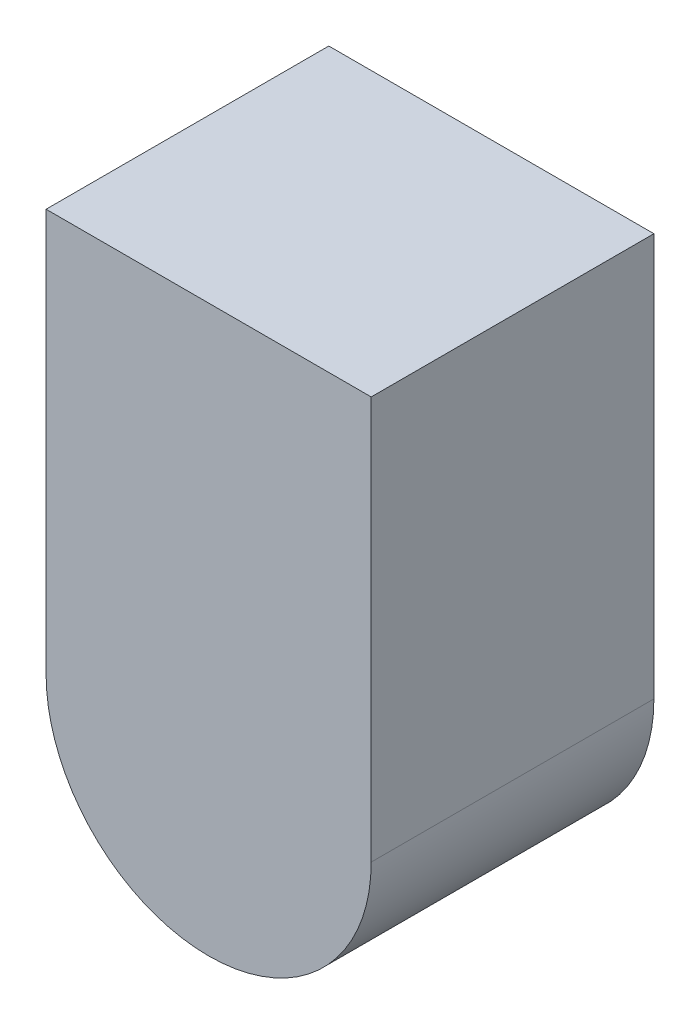
ISO-10303-21;
HEADER;
FILE_DESCRIPTION(('STEP AP214'),'2;1');
FILE_NAME('part.step','',(''),(''),'','','');
FILE_SCHEMA(('AUTOMOTIVE_DESIGN { 1 0 10303 214 1 1 1 1 }'));
ENDSEC;
DATA;
#1=APPLICATION_CONTEXT('core data for automotive mechanical design processes');
#2=APPLICATION_PROTOCOL_DEFINITION('international standard','automotive_design',2000,#1);
#3=PRODUCT_CONTEXT('',#1,'mechanical');
#4=PRODUCT('Part','Part','',(#3));
#5=PRODUCT_RELATED_PRODUCT_CATEGORY('part','',(#4));
#6=PRODUCT_DEFINITION_FORMATION('','',#4);
#7=PRODUCT_DEFINITION_CONTEXT('part definition',#1,'design');
#8=PRODUCT_DEFINITION('design','',#6,#7);
#9=PRODUCT_DEFINITION_SHAPE('','',#8);
#10=(LENGTH_UNIT() NAMED_UNIT(*) SI_UNIT(.MILLI.,.METRE.));
#11=(NAMED_UNIT(*) PLANE_ANGLE_UNIT() SI_UNIT($,.RADIAN.));
#12=(NAMED_UNIT(*) SI_UNIT($,.STERADIAN.) SOLID_ANGLE_UNIT());
#13=UNCERTAINTY_MEASURE_WITH_UNIT(LENGTH_MEASURE(1.E-05),#10,'distance_accuracy_value','');
#14=(GEOMETRIC_REPRESENTATION_CONTEXT(3) GLOBAL_UNCERTAINTY_ASSIGNED_CONTEXT((#13)) GLOBAL_UNIT_ASSIGNED_CONTEXT((#10,
#11,#12)) REPRESENTATION_CONTEXT('',''));
#15=CARTESIAN_POINT('',(0.,0.,0.));
#16=DIRECTION('',(0.,0.,1.));
#17=DIRECTION('',(1.,0.,0.));
#18=AXIS2_PLACEMENT_3D('',#15,#16,#17);
#19=CARTESIAN_POINT('',(0.750000000000001,2.8335240809167,0.2));
#20=DIRECTION('',(0.,0.,1.));
#21=DIRECTION('',(1.,0.,0.));
#22=AXIS2_PLACEMENT_3D('',#19,#20,#21);
#23=PLANE('',#22);
#24=DIRECTION('',(0.,1.,0.));
#25=VECTOR('',#24,1.);
#26=CARTESIAN_POINT('',(0.865,2.715,0.2));
#27=LINE('',#26,#25);
#28=CARTESIAN_POINT('',(0.865,2.715,0.2));
#29=VERTEX_POINT('',#28);
#30=CARTESIAN_POINT('',(0.865000000000001,3.,0.2));
#31=VERTEX_POINT('',#30);
#32=EDGE_CURVE('E11',#29,#31,#27,.T.);
#33=ORIENTED_EDGE('',*,*,#32,.T.);
#34=DIRECTION('',(-1.,0.,0.));
#35=VECTOR('',#34,1.);
#36=CARTESIAN_POINT('',(1.875,3.,0.2));
#37=LINE('',#36,#35);
#38=CARTESIAN_POINT('',(0.635000000000001,3.,0.2));
#39=VERTEX_POINT('',#38);
#40=EDGE_CURVE('E24',#31,#39,#37,.T.);
#41=ORIENTED_EDGE('',*,*,#40,.T.);
#42=DIRECTION('',(0.,-1.,0.));
#43=VECTOR('',#42,1.);
#44=CARTESIAN_POINT('',(0.635000000000001,3.,0.2));
#45=LINE('',#44,#43);
#46=CARTESIAN_POINT('',(0.635000000000001,2.715,0.2));
#47=VERTEX_POINT('',#46);
#48=EDGE_CURVE('E88',#39,#47,#45,.T.);
#49=ORIENTED_EDGE('',*,*,#48,.T.);
#50=CARTESIAN_POINT('',(0.75,2.715,0.2));
#51=DIRECTION('',(0.,0.,1.));
#52=DIRECTION('',(-1.,0.,0.));
#53=AXIS2_PLACEMENT_3D('',#50,#51,#52);
#54=CIRCLE('',#53,0.115);
#55=EDGE_CURVE('E70',#47,#29,#54,.T.);
#56=ORIENTED_EDGE('',*,*,#55,.T.);
#57=EDGE_LOOP('',(#33,#41,#49,#56));
#58=FACE_BOUND('',#57,.T.);
#59=ADVANCED_FACE('F17',(#58),#23,.T.);
#60=CARTESIAN_POINT('',(3.,3.,0.));
#61=DIRECTION('',(0.,1.,0.));
#62=DIRECTION('',(-1.,0.,0.));
#63=AXIS2_PLACEMENT_3D('',#60,#61,#62);
#64=PLANE('',#63);
#65=DIRECTION('',(0.,0.,-1.));
#66=VECTOR('',#65,1.);
#67=CARTESIAN_POINT('',(0.635000000000001,3.,0.));
#68=LINE('',#67,#66);
#69=CARTESIAN_POINT('',(0.635000000000001,3.,0.));
#70=VERTEX_POINT('',#69);
#71=EDGE_CURVE('E76',#39,#70,#68,.T.);
#72=ORIENTED_EDGE('',*,*,#71,.F.);
#73=ORIENTED_EDGE('',*,*,#40,.F.);
#74=DIRECTION('',(0.,0.,1.));
#75=VECTOR('',#74,1.);
#76=CARTESIAN_POINT('',(0.865000000000001,3.,0.));
#77=LINE('',#76,#75);
#78=CARTESIAN_POINT('',(0.865000000000001,3.,0.));
#79=VERTEX_POINT('',#78);
#80=EDGE_CURVE('E84',#79,#31,#77,.T.);
#81=ORIENTED_EDGE('',*,*,#80,.F.);
#82=DIRECTION('',(-1.,0.,0.));
#83=VECTOR('',#82,1.);
#84=CARTESIAN_POINT('',(0.865000000000001,3.,0.));
#85=LINE('',#84,#83);
#86=EDGE_CURVE('E82',#79,#70,#85,.T.);
#87=ORIENTED_EDGE('',*,*,#86,.T.);
#88=EDGE_LOOP('',(#72,#73,#81,#87));
#89=FACE_BOUND('',#88,.T.);
#90=ADVANCED_FACE('F90',(#89),#64,.T.);
#91=CARTESIAN_POINT('',(0.865,2.715,0.));
#92=DIRECTION('',(1.,0.,0.));
#93=DIRECTION('',(0.,1.,0.));
#94=AXIS2_PLACEMENT_3D('',#91,#92,#93);
#95=PLANE('',#94);
#96=DIRECTION('',(0.,1.,0.));
#97=VECTOR('',#96,1.);
#98=CARTESIAN_POINT('',(0.865,2.715,0.));
#99=LINE('',#98,#97);
#100=CARTESIAN_POINT('',(0.865,2.715,0.));
#101=VERTEX_POINT('',#100);
#102=EDGE_CURVE('E61',#101,#79,#99,.T.);
#103=ORIENTED_EDGE('',*,*,#102,.T.);
#104=ORIENTED_EDGE('',*,*,#80,.T.);
#105=ORIENTED_EDGE('',*,*,#32,.F.);
#106=DIRECTION('',(0.,0.,1.));
#107=VECTOR('',#106,1.);
#108=CARTESIAN_POINT('',(0.865,2.715,0.));
#109=LINE('',#108,#107);
#110=EDGE_CURVE('E64',#101,#29,#109,.T.);
#111=ORIENTED_EDGE('',*,*,#110,.F.);
#112=EDGE_LOOP('',(#103,#104,#105,#111));
#113=FACE_BOUND('',#112,.T.);
#114=ADVANCED_FACE('F91',(#113),#95,.T.);
#115=CARTESIAN_POINT('',(0.75,2.715,0.));
#116=DIRECTION('',(0.,0.,1.));
#117=DIRECTION('',(-1.,0.,0.));
#118=AXIS2_PLACEMENT_3D('',#115,#116,#117);
#119=CYLINDRICAL_SURFACE('',#118,0.115);
#120=CARTESIAN_POINT('',(0.75,2.715,0.));
#121=DIRECTION('',(0.,0.,1.));
#122=DIRECTION('',(-1.,0.,0.));
#123=AXIS2_PLACEMENT_3D('',#120,#121,#122);
#124=CIRCLE('',#123,0.115);
#125=CARTESIAN_POINT('',(0.635000000000001,2.715,0.));
#126=VERTEX_POINT('',#125);
#127=EDGE_CURVE('E54',#126,#101,#124,.T.);
#128=ORIENTED_EDGE('',*,*,#127,.T.);
#129=ORIENTED_EDGE('',*,*,#110,.T.);
#130=ORIENTED_EDGE('',*,*,#55,.F.);
#131=DIRECTION('',(0.,0.,1.));
#132=VECTOR('',#131,1.);
#133=CARTESIAN_POINT('',(0.635000000000001,2.715,0.));
#134=LINE('',#133,#132);
#135=EDGE_CURVE('E65',#126,#47,#134,.T.);
#136=ORIENTED_EDGE('',*,*,#135,.F.);
#137=EDGE_LOOP('',(#128,#129,#130,#136));
#138=FACE_BOUND('',#137,.T.);
#139=ADVANCED_FACE('F69',(#138),#119,.T.);
#140=CARTESIAN_POINT('',(0.635000000000001,3.,0.));
#141=DIRECTION('',(-1.,0.,0.));
#142=DIRECTION('',(0.,-1.,0.));
#143=AXIS2_PLACEMENT_3D('',#140,#141,#142);
#144=PLANE('',#143);
#145=DIRECTION('',(0.,-1.,0.));
#146=VECTOR('',#145,1.);
#147=CARTESIAN_POINT('',(0.635000000000001,3.,0.));
#148=LINE('',#147,#146);
#149=EDGE_CURVE('E59',#70,#126,#148,.T.);
#150=ORIENTED_EDGE('',*,*,#149,.T.);
#151=ORIENTED_EDGE('',*,*,#135,.T.);
#152=ORIENTED_EDGE('',*,*,#48,.F.);
#153=ORIENTED_EDGE('',*,*,#71,.T.);
#154=EDGE_LOOP('',(#150,#151,#152,#153));
#155=FACE_BOUND('',#154,.T.);
#156=ADVANCED_FACE('F74',(#155),#144,.T.);
#157=CARTESIAN_POINT('',(0.750000000000001,2.8335265642716,0.));
#158=DIRECTION('',(0.,0.,1.));
#159=DIRECTION('',(0.,-1.,0.));
#160=AXIS2_PLACEMENT_3D('',#157,#158,#159);
#161=PLANE('',#160);
#162=ORIENTED_EDGE('',*,*,#86,.F.);
#163=ORIENTED_EDGE('',*,*,#102,.F.);
#164=ORIENTED_EDGE('',*,*,#127,.F.);
#165=ORIENTED_EDGE('',*,*,#149,.F.);
#166=EDGE_LOOP('',(#162,#163,#164,#165));
#167=FACE_BOUND('',#166,.T.);
#168=ADVANCED_FACE('F57',(#167),#161,.F.);
#169=CLOSED_SHELL('',(#59,#90,#114,#139,#156,#168));
#170=MANIFOLD_SOLID_BREP('B1',#169);
#171=ADVANCED_BREP_SHAPE_REPRESENTATION('',(#18,#170),#14);
#172=SHAPE_DEFINITION_REPRESENTATION(#9,#171);
ENDSEC;
END-ISO-10303-21;
